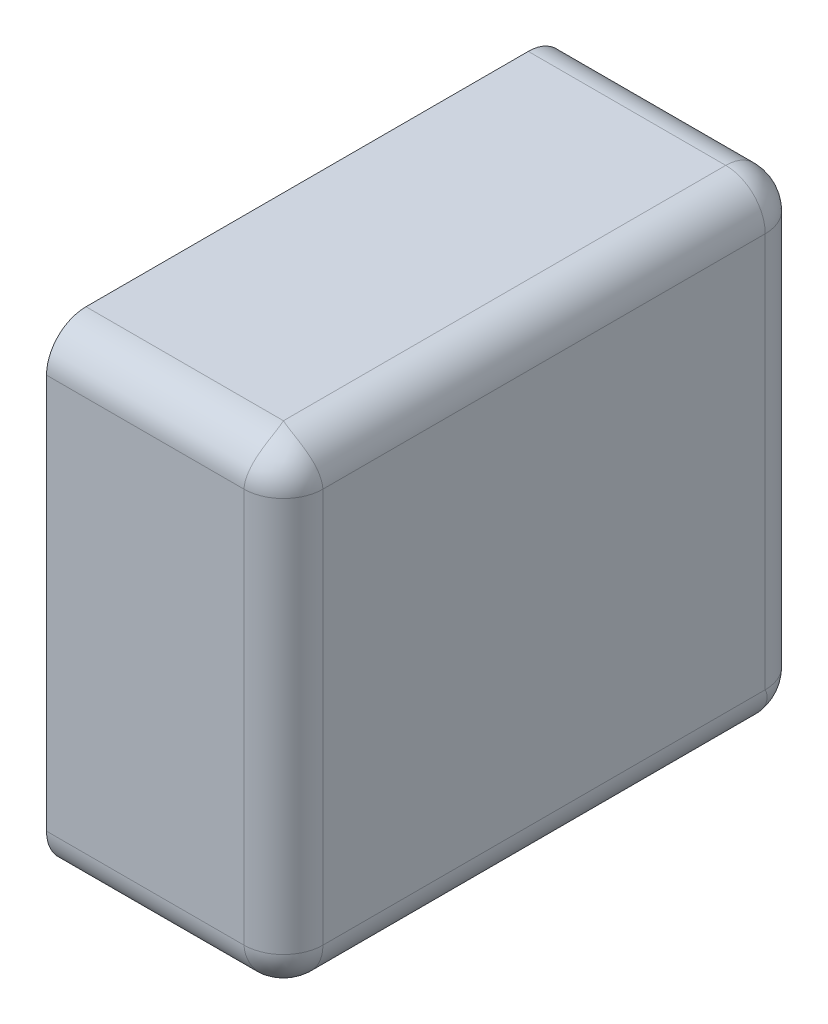
ISO-10303-21;
HEADER;
FILE_DESCRIPTION(('STEP AP214'),'2;1');
FILE_NAME('part.step','',(''),(''),'','','');
FILE_SCHEMA(('AUTOMOTIVE_DESIGN { 1 0 10303 214 1 1 1 1 }'));
ENDSEC;
DATA;
#1=APPLICATION_CONTEXT('core data for automotive mechanical design processes');
#2=APPLICATION_PROTOCOL_DEFINITION('international standard','automotive_design',2000,#1);
#3=PRODUCT_CONTEXT('',#1,'mechanical');
#4=PRODUCT('Part','Part','',(#3));
#5=PRODUCT_RELATED_PRODUCT_CATEGORY('part','',(#4));
#6=PRODUCT_DEFINITION_FORMATION('','',#4);
#7=PRODUCT_DEFINITION_CONTEXT('part definition',#1,'design');
#8=PRODUCT_DEFINITION('design','',#6,#7);
#9=PRODUCT_DEFINITION_SHAPE('','',#8);
#10=(LENGTH_UNIT() NAMED_UNIT(*) SI_UNIT(.MILLI.,.METRE.));
#11=(NAMED_UNIT(*) PLANE_ANGLE_UNIT() SI_UNIT($,.RADIAN.));
#12=(NAMED_UNIT(*) SI_UNIT($,.STERADIAN.) SOLID_ANGLE_UNIT());
#13=UNCERTAINTY_MEASURE_WITH_UNIT(LENGTH_MEASURE(1.E-05),#10,'distance_accuracy_value','');
#14=(GEOMETRIC_REPRESENTATION_CONTEXT(3) GLOBAL_UNCERTAINTY_ASSIGNED_CONTEXT((#13)) GLOBAL_UNIT_ASSIGNED_CONTEXT((#10,
#11,#12)) REPRESENTATION_CONTEXT('',''));
#15=CARTESIAN_POINT('',(0.,0.,0.));
#16=DIRECTION('',(0.,0.,1.));
#17=DIRECTION('',(1.,0.,0.));
#18=AXIS2_PLACEMENT_3D('',#15,#16,#17);
#19=CARTESIAN_POINT('',(0.275,-0.125,0.305));
#20=DIRECTION('',(-0.408248290463863,-0.816496580927726,-0.408248290463863));
#21=DIRECTION('',(0.577350269189626,-0.577350269189626,0.577350269189626));
#22=AXIS2_PLACEMENT_3D('',#19,#20,#21);
#23=SPHERICAL_SURFACE('',#22,0.025);
#24=CARTESIAN_POINT('',(0.275,-0.125,0.33));
#25=CARTESIAN_POINT('',(0.275028238320441,-0.125415676213834,0.330000010156983));
#26=CARTESIAN_POINT('',(0.275060584155778,-0.125831055562414,0.329989585658774));
#27=CARTESIAN_POINT('',(0.275132695597811,-0.126662012124376,0.329947847782519));
#28=CARTESIAN_POINT('',(0.27517249400072,-0.127077581785769,0.329916440434029));
#29=CARTESIAN_POINT('',(0.275258617335822,-0.127907618053038,0.329832548789631));
#30=CARTESIAN_POINT('',(0.275304968016668,-0.128322073397476,0.329779979751279));
#31=CARTESIAN_POINT('',(0.275403260408353,-0.129148608322681,0.329653686199178));
#32=CARTESIAN_POINT('',(0.275455221450125,-0.12956067417861,0.329579886981704));
#33=CARTESIAN_POINT('',(0.275563764376431,-0.130381173624576,0.329411146196174));
#34=CARTESIAN_POINT('',(0.275620359933804,-0.130789592213412,0.329316140529283));
#35=CARTESIAN_POINT('',(0.275737172088313,-0.131601566008371,0.329105097640512));
#36=CARTESIAN_POINT('',(0.275797397561427,-0.132005106135568,0.328989007342185));
#37=CARTESIAN_POINT('',(0.275920446097788,-0.132806120583724,0.328736002631376));
#38=CARTESIAN_POINT('',(0.275983274187963,-0.13320358092159,0.328599046407018));
#39=CARTESIAN_POINT('',(0.276110486774537,-0.133991266766944,0.328304614200733));
#40=CARTESIAN_POINT('',(0.276174873464478,-0.134381480526085,0.32814710774299));
#41=CARTESIAN_POINT('',(0.276304150405427,-0.135153541708901,0.32781197565844));
#42=CARTESIAN_POINT('',(0.276369041081861,-0.135535380708937,0.327634330792106));
#43=CARTESIAN_POINT('',(0.2764982676242,-0.136289602430892,0.327259417678732));
#44=CARTESIAN_POINT('',(0.276562603243719,-0.136661981083052,0.327062141159939));
#45=CARTESIAN_POINT('',(0.276689661956486,-0.137396237536021,0.326648554189678));
#46=CARTESIAN_POINT('',(0.276752385240264,-0.137758116578225,0.326432246000668));
#47=CARTESIAN_POINT('',(0.276875168414075,-0.138470378199732,0.325981276798632));
#48=CARTESIAN_POINT('',(0.276935230034102,-0.138820768206836,0.325746627988922));
#49=CARTESIAN_POINT('',(0.277051652032446,-0.139509108460251,0.32525974785284));
#50=CARTESIAN_POINT('',(0.277108016758089,-0.139847073104693,0.32500753792424));
#51=CARTESIAN_POINT('',(0.277216026256487,-0.140509674749009,0.324486392144794));
#52=CARTESIAN_POINT('',(0.277267679028739,-0.140834333801393,0.324217485995022));
#53=CARTESIAN_POINT('',(0.27736527107724,-0.141469494627518,0.323663887304665));
#54=CARTESIAN_POINT('',(0.277411222978854,-0.141780026684489,0.323379231742463));
#55=CARTESIAN_POINT('',(0.277496450824535,-0.142386164695101,0.322795152921738));
#56=CARTESIAN_POINT('',(0.277535744914638,-0.14268180962415,0.32249577276969));
#57=CARTESIAN_POINT('',(0.27760673152198,-0.143257467637576,0.321883338445124));
#58=CARTESIAN_POINT('',(0.277638448504513,-0.143537528729595,0.32157033224817));
#59=CARTESIAN_POINT('',(0.277693397712977,-0.144081378390888,0.32093180991951));
#60=CARTESIAN_POINT('',(0.277716661409129,-0.144345224212838,0.320606345279046));
#61=CARTESIAN_POINT('',(0.277753868669339,-0.144856069398077,0.319944135618163));
#62=CARTESIAN_POINT('',(0.277767851265375,-0.145103135339482,0.319607444174292));
#63=CARTESIAN_POINT('',(0.277785713896754,-0.145579914942669,0.318924070639427));
#64=CARTESIAN_POINT('',(0.277789640938912,-0.145809704451679,0.318577442722618));
#65=CARTESIAN_POINT('',(0.27778666785663,-0.146251494545238,0.317875540543628));
#66=CARTESIAN_POINT('',(0.277779822969552,-0.146463580049632,0.317520319530239));
#67=CARTESIAN_POINT('',(0.277754643821881,-0.146869595417803,0.316802624092122));
#68=CARTESIAN_POINT('',(0.277736373115599,-0.147063618935002,0.316440200456916));
#69=CARTESIAN_POINT('',(0.277687746810916,-0.147433213963009,0.315709535228763));
#70=CARTESIAN_POINT('',(0.277657462990763,-0.147608887378239,0.315341340447619));
#71=CARTESIAN_POINT('',(0.277584285466496,-0.147941556355398,0.314600604173974));
#72=CARTESIAN_POINT('',(0.277541471485359,-0.148098661446718,0.314228104043934));
#73=CARTESIAN_POINT('',(0.277442783056288,-0.148394038077465,0.313480258519227));
#74=CARTESIAN_POINT('',(0.277386995803688,-0.148532426005439,0.313104947635931));
#75=CARTESIAN_POINT('',(0.277261986649696,-0.148790282913471,0.312353001463475));
#76=CARTESIAN_POINT('',(0.277192858759549,-0.148909874234575,0.311976392569098));
#77=CARTESIAN_POINT('',(0.277040877699208,-0.149130119595873,0.311223398192717));
#78=CARTESIAN_POINT('',(0.276958124481167,-0.149230900910104,0.310847029768722));
#79=CARTESIAN_POINT('',(0.27677867186318,-0.149413582847158,0.310096030213761));
#80=CARTESIAN_POINT('',(0.276682077415673,-0.149495614474251,0.309721406146137));
#81=CARTESIAN_POINT('',(0.276526366184805,-0.149604779367685,0.30916097275375));
#82=CARTESIAN_POINT('',(0.276472819440888,-0.149638780077472,0.308974916302159));
#83=CARTESIAN_POINT('',(0.276362215583349,-0.14970212944545,0.308603818714183));
#84=CARTESIAN_POINT('',(0.276305172220562,-0.14973149488389,0.308418776370976));
#85=CARTESIAN_POINT('',(0.276187574740664,-0.149785596680384,0.30804990634783));
#86=CARTESIAN_POINT('',(0.276127034494639,-0.149810349876557,0.307866076710932));
#87=CARTESIAN_POINT('',(0.276002446002005,-0.149855256493048,0.30749982091122));
#88=CARTESIAN_POINT('',(0.275938411709227,-0.149875426755908,0.307317392070842));
#89=CARTESIAN_POINT('',(0.275806843842845,-0.149911199948112,0.306954128152848));
#90=CARTESIAN_POINT('',(0.275739324256391,-0.149926819681761,0.306773289666063));
#91=CARTESIAN_POINT('',(0.275600799894891,-0.149953528249625,0.306413394821305));
#92=CARTESIAN_POINT('',(0.275529809091912,-0.149964633803205,0.306234334328419));
#93=CARTESIAN_POINT('',(0.275384361385913,-0.149982353760455,0.305878182225797));
#94=CARTESIAN_POINT('',(0.275309918391982,-0.149988984753714,0.305701085764511));
#95=CARTESIAN_POINT('',(0.275157592486941,-0.149997800037759,0.305349047666083));
#96=CARTESIAN_POINT('',(0.27507972336566,-0.150000000737951,0.305174100471466));
#97=CARTESIAN_POINT('',(0.275,-0.15,0.305));
#98=B_SPLINE_CURVE_WITH_KNOTS('',3,(#24,#25,#26,#27,#28,#29,#30,#31,#32,#33,#34,#35,#36,#37,#38,
#39,#40,#41,#42,#43,#44,#45,#46,#47,#48,#49,#50,#51,#52,#53,#54,#55,#56,#57,#58,#59,#60,#61,#62,
#63,#64,#65,#66,#67,#68,#69,#70,#71,#72,#73,#74,#75,#76,#77,#78,#79,#80,#81,#82,#83,#84,#85,#86,
#87,#88,#89,#90,#91,#92,#93,#94,#95,#96,#97),.UNSPECIFIED.,.F.,.F.,(4,2,2,2,2,2,2,2,2,2,2,2,2,2,
2,2,2,2,2,2,2,2,2,2,2,2,2,2,2,2,2,2,2,2,2,2,4),(0.,0.00124972674914429,0.00250508818118087,
0.00376552755498708,0.00503045751811208,0.00629926393006443,0.00757130973543103,
0.008845938876384,0.0101224802356455,0.0114002516022038,0.0126785636530195,0.0139567239446434,
0.0152340409091005,0.0165098278485827,0.0177834069234384,0.0190541131276553,0.0203212982454898,
0.0215843347821014,0.0228426198599832,0.0240955790716335,0.0253426702772639,0.0265833873343771,
0.0278172637437544,0.0290438761937642,0.0302628479819393,0.0314738522894821,0.0326766152807867,
0.0338709189962572,0.0350566040027588,0.0356462463463343,0.0362337025741548,0.0368189702268576,
0.0374020508853402,0.0379829502134117,0.0385616779934515,0.0391382481546671,0.0397126787935412),.UNSPECIFIED.);
#99=CARTESIAN_POINT('',(0.275,-0.125,0.33));
#100=VERTEX_POINT('',#99);
#101=CARTESIAN_POINT('',(0.275,-0.15,0.305));
#102=VERTEX_POINT('',#101);
#103=EDGE_CURVE('E11',#100,#102,#98,.T.);
#104=ORIENTED_EDGE('',*,*,#103,.T.);
#105=CARTESIAN_POINT('',(0.275,-0.125,0.305));
#106=DIRECTION('',(0.,0.,1.));
#107=DIRECTION('',(1.,0.,0.));
#108=AXIS2_PLACEMENT_3D('',#105,#106,#107);
#109=CIRCLE('',#108,0.025);
#110=CARTESIAN_POINT('',(0.3,-0.125,0.305));
#111=VERTEX_POINT('',#110);
#112=EDGE_CURVE('E25',#102,#111,#109,.T.);
#113=ORIENTED_EDGE('',*,*,#112,.T.);
#114=CARTESIAN_POINT('',(0.275,-0.125,0.305));
#115=DIRECTION('',(0.,-1.,0.));
#116=DIRECTION('',(0.,0.,1.));
#117=AXIS2_PLACEMENT_3D('',#114,#115,#116);
#118=CIRCLE('',#117,0.025);
#119=EDGE_CURVE('E279',#111,#100,#118,.T.);
#120=ORIENTED_EDGE('',*,*,#119,.T.);
#121=EDGE_LOOP('',(#104,#113,#120));
#122=FACE_BOUND('',#121,.T.);
#123=ADVANCED_FACE('F17',(#122),#23,.T.);
#124=CARTESIAN_POINT('',(0.275,-0.125,0.025));
#125=DIRECTION('',(-0.816496580927726,-0.408248290463864,-0.408248290463863));
#126=DIRECTION('',(0.577350269189626,-0.577350269189626,-0.577350269189626));
#127=AXIS2_PLACEMENT_3D('',#124,#125,#126);
#128=SPHERICAL_SURFACE('',#127,0.025);
#129=CARTESIAN_POINT('',(0.3,-0.125,0.025));
#130=CARTESIAN_POINT('',(0.300000000737951,-0.125174100471466,0.0249202766343398));
#131=CARTESIAN_POINT('',(0.299997800037759,-0.125349047666083,0.0248424075130585));
#132=CARTESIAN_POINT('',(0.299988984753714,-0.125701085764511,0.0246900816080177));
#133=CARTESIAN_POINT('',(0.299982353760455,-0.125878182225797,0.0246156386140871));
#134=CARTESIAN_POINT('',(0.299964633803205,-0.126234334328419,0.0244701909080881));
#135=CARTESIAN_POINT('',(0.299953528249625,-0.126413394821305,0.0243992001051096));
#136=CARTESIAN_POINT('',(0.299926819681761,-0.126773289666063,0.0242606757436093));
#137=CARTESIAN_POINT('',(0.299911199948112,-0.126954128152848,0.0241931561571548));
#138=CARTESIAN_POINT('',(0.299875426755908,-0.127317392070842,0.0240615882907726));
#139=CARTESIAN_POINT('',(0.299855256493048,-0.12749982091122,0.0239975539979947));
#140=CARTESIAN_POINT('',(0.299810349876557,-0.127866076710932,0.023872965505361));
#141=CARTESIAN_POINT('',(0.299785596680384,-0.12804990634783,0.0238124252593363));
#142=CARTESIAN_POINT('',(0.29973149488389,-0.128418776370976,0.0236948277794382));
#143=CARTESIAN_POINT('',(0.29970212944545,-0.128603818714183,0.0236377844166513));
#144=CARTESIAN_POINT('',(0.299638780077472,-0.128974916302159,0.0235271805591116));
#145=CARTESIAN_POINT('',(0.299604779367685,-0.12916097275375,0.0234736338151953));
#146=CARTESIAN_POINT('',(0.299495614474251,-0.129721406146137,0.023317922584327));
#147=CARTESIAN_POINT('',(0.299413582847159,-0.130096030213761,0.0232213281368203));
#148=CARTESIAN_POINT('',(0.299230900910104,-0.130847029768722,0.0230418755188332));
#149=CARTESIAN_POINT('',(0.299130119595873,-0.131223398192717,0.0229591223007916));
#150=CARTESIAN_POINT('',(0.298909874234575,-0.131976392569098,0.0228071412404509));
#151=CARTESIAN_POINT('',(0.298790282913471,-0.132353001463475,0.0227380133503036));
#152=CARTESIAN_POINT('',(0.298532426005439,-0.133104947635931,0.0226130041963119));
#153=CARTESIAN_POINT('',(0.298394038077466,-0.133480258519227,0.0225572169437125));
#154=CARTESIAN_POINT('',(0.298098661446718,-0.134228104043934,0.0224585285146415));
#155=CARTESIAN_POINT('',(0.297941556355398,-0.134600604173974,0.0224157145335039));
#156=CARTESIAN_POINT('',(0.297608887378239,-0.135341340447619,0.0223425370092372));
#157=CARTESIAN_POINT('',(0.297433213963008,-0.135709535228763,0.0223122531890843));
#158=CARTESIAN_POINT('',(0.297063618935002,-0.136440200456916,0.0222636268844006));
#159=CARTESIAN_POINT('',(0.296869595417803,-0.136802624092122,0.0222453561781187));
#160=CARTESIAN_POINT('',(0.296463580049632,-0.137520319530238,0.0222201770304482));
#161=CARTESIAN_POINT('',(0.296251494545238,-0.137875540543628,0.0222133321433696));
#162=CARTESIAN_POINT('',(0.295809704451679,-0.138577442722618,0.0222103590610882));
#163=CARTESIAN_POINT('',(0.295579914942669,-0.138924070639427,0.0222142861032459));
#164=CARTESIAN_POINT('',(0.295103135339482,-0.139607444174292,0.022232148734625));
#165=CARTESIAN_POINT('',(0.294856069398077,-0.139944135618163,0.0222461313306608));
#166=CARTESIAN_POINT('',(0.294345224212838,-0.140606345279047,0.0222833385908708));
#167=CARTESIAN_POINT('',(0.294081378390888,-0.14093180991951,0.0223066022870233));
#168=CARTESIAN_POINT('',(0.293537528729595,-0.14157033224817,0.0223615514954871));
#169=CARTESIAN_POINT('',(0.293257467637576,-0.141883338445124,0.0223932684780205));
#170=CARTESIAN_POINT('',(0.29268180962415,-0.14249577276969,0.0224642550853625));
#171=CARTESIAN_POINT('',(0.292386164695101,-0.142795152921738,0.0225035491754646));
#172=CARTESIAN_POINT('',(0.291780026684489,-0.143379231742463,0.0225887770211462));
#173=CARTESIAN_POINT('',(0.291469494627518,-0.143663887304665,0.0226347289227604));
#174=CARTESIAN_POINT('',(0.290834333801393,-0.144217485995022,0.0227323209712611));
#175=CARTESIAN_POINT('',(0.290509674749009,-0.144486392144794,0.0227839737435128));
#176=CARTESIAN_POINT('',(0.289847073104693,-0.14500753792424,0.0228919832419115));
#177=CARTESIAN_POINT('',(0.289509108460251,-0.14525974785284,0.0229483479675545));
#178=CARTESIAN_POINT('',(0.288820768206836,-0.145746627988922,0.0230647699658976));
#179=CARTESIAN_POINT('',(0.288470378199732,-0.145981276798632,0.0231248315859255));
#180=CARTESIAN_POINT('',(0.287758116578225,-0.146432246000668,0.023247614759736));
#181=CARTESIAN_POINT('',(0.287396237536021,-0.146648554189678,0.0233103380435141));
#182=CARTESIAN_POINT('',(0.286661981083052,-0.147062141159939,0.0234373967562814));
#183=CARTESIAN_POINT('',(0.286289602430892,-0.147259417678732,0.0235017323758004));
#184=CARTESIAN_POINT('',(0.285535380708937,-0.147634330792106,0.0236309589181388));
#185=CARTESIAN_POINT('',(0.285153541708901,-0.14781197565844,0.0236958495945734));
#186=CARTESIAN_POINT('',(0.284381480526085,-0.14814710774299,0.0238251265355221));
#187=CARTESIAN_POINT('',(0.283991266766944,-0.148304614200733,0.0238895132254628));
#188=CARTESIAN_POINT('',(0.28320358092159,-0.148599046407018,0.0240167258120374));
#189=CARTESIAN_POINT('',(0.282806120583724,-0.148736002631376,0.0240795539022123));
#190=CARTESIAN_POINT('',(0.282005106135568,-0.148989007342185,0.0242026024385734));
#191=CARTESIAN_POINT('',(0.281601566008371,-0.149105097640512,0.0242628279116871));
#192=CARTESIAN_POINT('',(0.280789592213412,-0.149316140529283,0.0243796400661957));
#193=CARTESIAN_POINT('',(0.280381173624576,-0.149411146196174,0.0244362356235691));
#194=CARTESIAN_POINT('',(0.27956067417861,-0.149579886981704,0.0245447785498749));
#195=CARTESIAN_POINT('',(0.279148608322681,-0.149653686199178,0.0245967395916468));
#196=CARTESIAN_POINT('',(0.278322073397476,-0.149779979751279,0.0246950319833321));
#197=CARTESIAN_POINT('',(0.277907618053038,-0.149832548789631,0.0247413826641783));
#198=CARTESIAN_POINT('',(0.277077581785769,-0.149916440434029,0.0248275059992805));
#199=CARTESIAN_POINT('',(0.276662012124376,-0.149947847782519,0.0248673044021885));
#200=CARTESIAN_POINT('',(0.275831055562414,-0.149989585658774,0.0249394158442217));
#201=CARTESIAN_POINT('',(0.275415676213834,-0.150000010156983,0.0249717616795592));
#202=CARTESIAN_POINT('',(0.275,-0.15,0.025));
#203=B_SPLINE_CURVE_WITH_KNOTS('',3,(#129,#130,#131,#132,#133,#134,#135,#136,#137,#138,#139,
#140,#141,#142,#143,#144,#145,#146,#147,#148,#149,#150,#151,#152,#153,#154,#155,#156,#157,#158,
#159,#160,#161,#162,#163,#164,#165,#166,#167,#168,#169,#170,#171,#172,#173,#174,#175,#176,#177,
#178,#179,#180,#181,#182,#183,#184,#185,#186,#187,#188,#189,#190,#191,#192,#193,#194,#195,#196,
#197,#198,#199,#200,#201,#202),.UNSPECIFIED.,.F.,.F.,(4,2,2,2,2,2,2,2,2,2,2,2,2,2,2,2,2,2,2,2,2,
2,2,2,2,2,2,2,2,2,2,2,2,2,2,2,4),(0.,0.000574430638874108,0.00115100080008966,
0.00172972858012947,0.00231062790820101,0.00289370856668359,0.00347897621938641,
0.00406643244720695,0.00465607479078238,0.00584175979728407,0.00703606351275455,
0.00823882650405907,0.00944983081160196,0.010668802599777,0.0118954150497868,0.013129291459164,
0.0143700085162773,0.0156170997219077,0.016870058933558,0.0181283440114399,0.0193913805480515,
0.020658565665886,0.0219292718701028,0.0232028509449585,0.0244786378844408,0.0257559548488978,
0.0270341151405217,0.0283124271913374,0.0295901985578957,0.0308667399171573,0.0321413690581102,
0.0334134148634768,0.0346822212754292,0.0359471512385541,0.0372075906123603,0.038462952044397,
0.0397126787935412),.UNSPECIFIED.);
#204=CARTESIAN_POINT('',(0.3,-0.125,0.025));
#205=VERTEX_POINT('',#204);
#206=CARTESIAN_POINT('',(0.275,-0.15,0.025));
#207=VERTEX_POINT('',#206);
#208=EDGE_CURVE('E275',#205,#207,#203,.T.);
#209=ORIENTED_EDGE('',*,*,#208,.T.);
#210=CARTESIAN_POINT('',(0.275,-0.125,0.025));
#211=DIRECTION('',(1.,0.,0.));
#212=DIRECTION('',(0.,0.,-1.));
#213=AXIS2_PLACEMENT_3D('',#210,#211,#212);
#214=CIRCLE('',#213,0.025);
#215=CARTESIAN_POINT('',(0.275,-0.125,0.));
#216=VERTEX_POINT('',#215);
#217=EDGE_CURVE('E304',#207,#216,#214,.T.);
#218=ORIENTED_EDGE('',*,*,#217,.T.);
#219=CARTESIAN_POINT('',(0.275,-0.125,0.025));
#220=DIRECTION('',(0.,-1.,0.));
#221=DIRECTION('',(1.,0.,0.));
#222=AXIS2_PLACEMENT_3D('',#219,#220,#221);
#223=CIRCLE('',#222,0.025);
#224=EDGE_CURVE('E311',#216,#205,#223,.T.);
#225=ORIENTED_EDGE('',*,*,#224,.T.);
#226=EDGE_LOOP('',(#209,#218,#225));
#227=FACE_BOUND('',#226,.T.);
#228=ADVANCED_FACE('F257',(#227),#128,.T.);
#229=CARTESIAN_POINT('',(0.1875,-0.125,0.025));
#230=DIRECTION('',(1.,0.,0.));
#231=DIRECTION('',(0.,-0.707106781186548,-0.707106781186547));
#232=AXIS2_PLACEMENT_3D('',#229,#230,#231);
#233=CYLINDRICAL_SURFACE('',#232,0.025);
#234=CARTESIAN_POINT('',(0.15,-0.125,0.025));
#235=DIRECTION('',(1.,0.,0.));
#236=DIRECTION('',(0.,-0.707106781186548,-0.707106781186547));
#237=AXIS2_PLACEMENT_3D('',#234,#235,#236);
#238=CIRCLE('',#237,0.025);
#239=CARTESIAN_POINT('',(0.15,-0.15,0.025));
#240=VERTEX_POINT('',#239);
#241=CARTESIAN_POINT('',(0.15,-0.125,0.));
#242=VERTEX_POINT('',#241);
#243=EDGE_CURVE('E315',#240,#242,#238,.T.);
#244=ORIENTED_EDGE('',*,*,#243,.T.);
#245=DIRECTION('',(1.,0.,0.));
#246=VECTOR('',#245,1.);
#247=CARTESIAN_POINT('',(0.1875,-0.125,0.));
#248=LINE('',#247,#246);
#249=EDGE_CURVE('E319',#242,#216,#248,.T.);
#250=ORIENTED_EDGE('',*,*,#249,.T.);
#251=ORIENTED_EDGE('',*,*,#217,.F.);
#252=DIRECTION('',(-1.,0.,0.));
#253=VECTOR('',#252,1.);
#254=CARTESIAN_POINT('',(0.1875,-0.15,0.025));
#255=LINE('',#254,#253);
#256=EDGE_CURVE('E322',#207,#240,#255,.T.);
#257=ORIENTED_EDGE('',*,*,#256,.T.);
#258=EDGE_LOOP('',(#244,#250,#251,#257));
#259=FACE_BOUND('',#258,.T.);
#260=ADVANCED_FACE('F246',(#259),#233,.T.);
#261=CARTESIAN_POINT('',(0.275,0.125,0.305));
#262=DIRECTION('',(0.408248290463862,-0.816496580927727,0.408248290463862));
#263=DIRECTION('',(0.577350269189627,0.577350269189624,0.577350269189627));
#264=AXIS2_PLACEMENT_3D('',#261,#262,#263);
#265=SPHERICAL_SURFACE('',#264,0.025);
#266=CARTESIAN_POINT('',(0.275,0.125,0.305));
#267=DIRECTION('',(0.,1.,0.));
#268=DIRECTION('',(1.,0.,0.));
#269=AXIS2_PLACEMENT_3D('',#266,#267,#268);
#270=CIRCLE('',#269,0.025);
#271=CARTESIAN_POINT('',(0.275,0.125,0.33));
#272=VERTEX_POINT('',#271);
#273=CARTESIAN_POINT('',(0.3,0.125,0.305));
#274=VERTEX_POINT('',#273);
#275=EDGE_CURVE('E325',#272,#274,#270,.T.);
#276=ORIENTED_EDGE('',*,*,#275,.T.);
#277=CARTESIAN_POINT('',(0.3,0.125,0.305));
#278=CARTESIAN_POINT('',(0.300000010156984,0.125415676213834,0.305028238320441));
#279=CARTESIAN_POINT('',(0.299989585658774,0.125831055562414,0.305060584155778));
#280=CARTESIAN_POINT('',(0.299947847782519,0.126662012124376,0.305132695597811));
#281=CARTESIAN_POINT('',(0.299916440434029,0.127077581785769,0.30517249400072));
#282=CARTESIAN_POINT('',(0.299832548789631,0.127907618053038,0.305258617335822));
#283=CARTESIAN_POINT('',(0.299779979751279,0.128322073397476,0.305304968016668));
#284=CARTESIAN_POINT('',(0.299653686199178,0.129148608322681,0.305403260408353));
#285=CARTESIAN_POINT('',(0.299579886981704,0.12956067417861,0.305455221450125));
#286=CARTESIAN_POINT('',(0.299411146196174,0.130381173624576,0.305563764376431));
#287=CARTESIAN_POINT('',(0.299316140529283,0.130789592213412,0.305620359933804));
#288=CARTESIAN_POINT('',(0.299105097640512,0.131601566008371,0.305737172088313));
#289=CARTESIAN_POINT('',(0.298989007342185,0.132005106135568,0.305797397561427));
#290=CARTESIAN_POINT('',(0.298736002631376,0.132806120583724,0.305920446097788));
#291=CARTESIAN_POINT('',(0.298599046407018,0.13320358092159,0.305983274187963));
#292=CARTESIAN_POINT('',(0.298304614200733,0.133991266766944,0.306110486774537));
#293=CARTESIAN_POINT('',(0.29814710774299,0.134381480526085,0.306174873464478));
#294=CARTESIAN_POINT('',(0.29781197565844,0.135153541708901,0.306304150405427));
#295=CARTESIAN_POINT('',(0.297634330792106,0.135535380708937,0.306369041081861));
#296=CARTESIAN_POINT('',(0.297259417678732,0.136289602430892,0.3064982676242));
#297=CARTESIAN_POINT('',(0.297062141159939,0.136661981083052,0.306562603243719));
#298=CARTESIAN_POINT('',(0.296648554189678,0.137396237536021,0.306689661956486));
#299=CARTESIAN_POINT('',(0.296432246000668,0.137758116578225,0.306752385240264));
#300=CARTESIAN_POINT('',(0.295981276798632,0.138470378199732,0.306875168414075));
#301=CARTESIAN_POINT('',(0.295746627988922,0.138820768206836,0.306935230034102));
#302=CARTESIAN_POINT('',(0.29525974785284,0.139509108460252,0.307051652032446));
#303=CARTESIAN_POINT('',(0.29500753792424,0.139847073104693,0.307108016758089));
#304=CARTESIAN_POINT('',(0.294486392144794,0.140509674749009,0.307216026256487));
#305=CARTESIAN_POINT('',(0.294217485995022,0.140834333801393,0.307267679028739));
#306=CARTESIAN_POINT('',(0.293663887304665,0.141469494627518,0.30736527107724));
#307=CARTESIAN_POINT('',(0.293379231742463,0.141780026684489,0.307411222978854));
#308=CARTESIAN_POINT('',(0.292795152921738,0.142386164695101,0.307496450824535));
#309=CARTESIAN_POINT('',(0.29249577276969,0.14268180962415,0.307535744914638));
#310=CARTESIAN_POINT('',(0.291883338445124,0.143257467637576,0.30760673152198));
#311=CARTESIAN_POINT('',(0.29157033224817,0.143537528729595,0.307638448504513));
#312=CARTESIAN_POINT('',(0.29093180991951,0.144081378390888,0.307693397712977));
#313=CARTESIAN_POINT('',(0.290606345279046,0.144345224212838,0.307716661409129));
#314=CARTESIAN_POINT('',(0.289944135618163,0.144856069398077,0.307753868669339));
#315=CARTESIAN_POINT('',(0.289607444174292,0.145103135339482,0.307767851265375));
#316=CARTESIAN_POINT('',(0.288924070639427,0.145579914942669,0.307785713896754));
#317=CARTESIAN_POINT('',(0.288577442722618,0.145809704451679,0.307789640938912));
#318=CARTESIAN_POINT('',(0.287875540543628,0.146251494545238,0.30778666785663));
#319=CARTESIAN_POINT('',(0.287520319530238,0.146463580049632,0.307779822969552));
#320=CARTESIAN_POINT('',(0.286802624092122,0.146869595417803,0.307754643821881));
#321=CARTESIAN_POINT('',(0.286440200456916,0.147063618935002,0.307736373115599));
#322=CARTESIAN_POINT('',(0.285709535228763,0.147433213963009,0.307687746810916));
#323=CARTESIAN_POINT('',(0.285341340447619,0.147608887378239,0.307657462990763));
#324=CARTESIAN_POINT('',(0.284600604173974,0.147941556355398,0.307584285466496));
#325=CARTESIAN_POINT('',(0.284228104043934,0.148098661446718,0.307541471485358));
#326=CARTESIAN_POINT('',(0.283480258519227,0.148394038077466,0.307442783056287));
#327=CARTESIAN_POINT('',(0.283104947635931,0.148532426005439,0.307386995803688));
#328=CARTESIAN_POINT('',(0.282353001463475,0.148790282913471,0.307261986649696));
#329=CARTESIAN_POINT('',(0.281976392569098,0.148909874234575,0.307192858759549));
#330=CARTESIAN_POINT('',(0.281223398192717,0.149130119595873,0.307040877699208));
#331=CARTESIAN_POINT('',(0.280847029768722,0.149230900910104,0.306958124481167));
#332=CARTESIAN_POINT('',(0.280096030213761,0.149413582847158,0.30677867186318));
#333=CARTESIAN_POINT('',(0.279721406146137,0.149495614474251,0.306682077415673));
#334=CARTESIAN_POINT('',(0.27916097275375,0.149604779367685,0.306526366184805));
#335=CARTESIAN_POINT('',(0.278974916302159,0.149638780077472,0.306472819440888));
#336=CARTESIAN_POINT('',(0.278603818714183,0.14970212944545,0.306362215583349));
#337=CARTESIAN_POINT('',(0.278418776370976,0.14973149488389,0.306305172220562));
#338=CARTESIAN_POINT('',(0.27804990634783,0.149785596680384,0.306187574740664));
#339=CARTESIAN_POINT('',(0.277866076710932,0.149810349876557,0.306127034494639));
#340=CARTESIAN_POINT('',(0.27749982091122,0.149855256493048,0.306002446002005));
#341=CARTESIAN_POINT('',(0.277317392070842,0.149875426755908,0.305938411709227));
#342=CARTESIAN_POINT('',(0.276954128152848,0.149911199948112,0.305806843842845));
#343=CARTESIAN_POINT('',(0.276773289666063,0.149926819681761,0.305739324256391));
#344=CARTESIAN_POINT('',(0.276413394821305,0.149953528249625,0.30560079989489));
#345=CARTESIAN_POINT('',(0.276234334328419,0.149964633803205,0.305529809091912));
#346=CARTESIAN_POINT('',(0.275878182225797,0.149982353760455,0.305384361385913));
#347=CARTESIAN_POINT('',(0.275701085764511,0.149988984753714,0.305309918391982));
#348=CARTESIAN_POINT('',(0.275349047666083,0.149997800037759,0.305157592486941));
#349=CARTESIAN_POINT('',(0.275174100471466,0.150000000737951,0.30507972336566));
#350=CARTESIAN_POINT('',(0.275,0.15,0.305));
#351=B_SPLINE_CURVE_WITH_KNOTS('',3,(#277,#278,#279,#280,#281,#282,#283,#284,#285,#286,#287,
#288,#289,#290,#291,#292,#293,#294,#295,#296,#297,#298,#299,#300,#301,#302,#303,#304,#305,#306,
#307,#308,#309,#310,#311,#312,#313,#314,#315,#316,#317,#318,#319,#320,#321,#322,#323,#324,#325,
#326,#327,#328,#329,#330,#331,#332,#333,#334,#335,#336,#337,#338,#339,#340,#341,#342,#343,#344,
#345,#346,#347,#348,#349,#350),.UNSPECIFIED.,.F.,.F.,(4,2,2,2,2,2,2,2,2,2,2,2,2,2,2,2,2,2,2,2,2,
2,2,2,2,2,2,2,2,2,2,2,2,2,2,2,4),(0.,0.00124972674914427,0.00250508818118087,
0.00376552755498708,0.00503045751811208,0.00629926393006441,0.00757130973543101,
0.00884593887638399,0.0101224802356455,0.0114002516022038,0.0126785636530195,0.0139567239446433,
0.0152340409091005,0.0165098278485827,0.0177834069234384,0.0190541131276553,0.0203212982454898,
0.0215843347821014,0.0228426198599832,0.0240955790716335,0.0253426702772639,0.0265833873343772,
0.0278172637437543,0.0290438761937642,0.0302628479819393,0.0314738522894822,0.0326766152807867,
0.0338709189962572,0.0350566040027589,0.0356462463463343,0.0362337025741548,0.0368189702268576,
0.0374020508853402,0.0379829502134117,0.0385616779934515,0.0391382481546671,0.0397126787935412),.UNSPECIFIED.);
#352=CARTESIAN_POINT('',(0.275,0.15,0.305));
#353=VERTEX_POINT('',#352);
#354=EDGE_CURVE('E228',#274,#353,#351,.T.);
#355=ORIENTED_EDGE('',*,*,#354,.T.);
#356=CARTESIAN_POINT('',(0.275,0.15,0.305));
#357=CARTESIAN_POINT('',(0.27507972336566,0.150000000737951,0.305174100471466));
#358=CARTESIAN_POINT('',(0.275157592486941,0.149997800037759,0.305349047666083));
#359=CARTESIAN_POINT('',(0.275309918391982,0.149988984753714,0.30570108576451));
#360=CARTESIAN_POINT('',(0.275384361385913,0.149982353760455,0.305878182225797));
#361=CARTESIAN_POINT('',(0.275529809091912,0.149964633803205,0.306234334328419));
#362=CARTESIAN_POINT('',(0.27560079989489,0.149953528249625,0.306413394821305));
#363=CARTESIAN_POINT('',(0.275739324256391,0.149926819681761,0.306773289666063));
#364=CARTESIAN_POINT('',(0.275806843842845,0.149911199948112,0.306954128152848));
#365=CARTESIAN_POINT('',(0.275938411709227,0.149875426755908,0.307317392070842));
#366=CARTESIAN_POINT('',(0.276002446002005,0.149855256493048,0.30749982091122));
#367=CARTESIAN_POINT('',(0.276127034494639,0.149810349876557,0.307866076710932));
#368=CARTESIAN_POINT('',(0.276187574740664,0.149785596680384,0.30804990634783));
#369=CARTESIAN_POINT('',(0.276305172220562,0.14973149488389,0.308418776370976));
#370=CARTESIAN_POINT('',(0.276362215583349,0.14970212944545,0.308603818714183));
#371=CARTESIAN_POINT('',(0.276472819440888,0.149638780077472,0.308974916302159));
#372=CARTESIAN_POINT('',(0.276526366184805,0.149604779367685,0.30916097275375));
#373=CARTESIAN_POINT('',(0.276682077415673,0.149495614474251,0.309721406146137));
#374=CARTESIAN_POINT('',(0.27677867186318,0.149413582847159,0.310096030213761));
#375=CARTESIAN_POINT('',(0.276958124481167,0.149230900910104,0.310847029768722));
#376=CARTESIAN_POINT('',(0.277040877699208,0.149130119595873,0.311223398192717));
#377=CARTESIAN_POINT('',(0.277192858759549,0.148909874234575,0.311976392569098));
#378=CARTESIAN_POINT('',(0.277261986649696,0.148790282913471,0.312353001463475));
#379=CARTESIAN_POINT('',(0.277386995803688,0.148532426005439,0.313104947635931));
#380=CARTESIAN_POINT('',(0.277442783056288,0.148394038077466,0.313480258519227));
#381=CARTESIAN_POINT('',(0.277541471485359,0.148098661446718,0.314228104043934));
#382=CARTESIAN_POINT('',(0.277584285466496,0.147941556355398,0.314600604173974));
#383=CARTESIAN_POINT('',(0.277657462990763,0.147608887378239,0.315341340447619));
#384=CARTESIAN_POINT('',(0.277687746810916,0.147433213963009,0.315709535228763));
#385=CARTESIAN_POINT('',(0.277736373115599,0.147063618935002,0.316440200456916));
#386=CARTESIAN_POINT('',(0.277754643821881,0.146869595417803,0.316802624092122));
#387=CARTESIAN_POINT('',(0.277779822969552,0.146463580049632,0.317520319530238));
#388=CARTESIAN_POINT('',(0.27778666785663,0.146251494545238,0.317875540543628));
#389=CARTESIAN_POINT('',(0.277789640938912,0.145809704451679,0.318577442722617));
#390=CARTESIAN_POINT('',(0.277785713896754,0.145579914942669,0.318924070639427));
#391=CARTESIAN_POINT('',(0.277767851265375,0.145103135339482,0.319607444174292));
#392=CARTESIAN_POINT('',(0.277753868669339,0.144856069398077,0.319944135618163));
#393=CARTESIAN_POINT('',(0.277716661409129,0.144345224212838,0.320606345279046));
#394=CARTESIAN_POINT('',(0.277693397712977,0.144081378390888,0.32093180991951));
#395=CARTESIAN_POINT('',(0.277638448504513,0.143537528729595,0.32157033224817));
#396=CARTESIAN_POINT('',(0.27760673152198,0.143257467637576,0.321883338445124));
#397=CARTESIAN_POINT('',(0.277535744914638,0.14268180962415,0.32249577276969));
#398=CARTESIAN_POINT('',(0.277496450824535,0.142386164695101,0.322795152921738));
#399=CARTESIAN_POINT('',(0.277411222978854,0.141780026684489,0.323379231742463));
#400=CARTESIAN_POINT('',(0.27736527107724,0.141469494627518,0.323663887304665));
#401=CARTESIAN_POINT('',(0.277267679028739,0.140834333801393,0.324217485995022));
#402=CARTESIAN_POINT('',(0.277216026256487,0.140509674749009,0.324486392144794));
#403=CARTESIAN_POINT('',(0.277108016758089,0.139847073104693,0.32500753792424));
#404=CARTESIAN_POINT('',(0.277051652032446,0.139509108460252,0.32525974785284));
#405=CARTESIAN_POINT('',(0.276935230034102,0.138820768206836,0.325746627988922));
#406=CARTESIAN_POINT('',(0.276875168414075,0.138470378199732,0.325981276798632));
#407=CARTESIAN_POINT('',(0.276752385240264,0.137758116578225,0.326432246000668));
#408=CARTESIAN_POINT('',(0.276689661956486,0.137396237536021,0.326648554189678));
#409=CARTESIAN_POINT('',(0.276562603243719,0.136661981083052,0.327062141159939));
#410=CARTESIAN_POINT('',(0.2764982676242,0.136289602430892,0.327259417678732));
#411=CARTESIAN_POINT('',(0.276369041081861,0.135535380708937,0.327634330792106));
#412=CARTESIAN_POINT('',(0.276304150405427,0.135153541708901,0.32781197565844));
#413=CARTESIAN_POINT('',(0.276174873464478,0.134381480526085,0.32814710774299));
#414=CARTESIAN_POINT('',(0.276110486774537,0.133991266766944,0.328304614200733));
#415=CARTESIAN_POINT('',(0.275983274187963,0.13320358092159,0.328599046407018));
#416=CARTESIAN_POINT('',(0.275920446097788,0.132806120583724,0.328736002631376));
#417=CARTESIAN_POINT('',(0.275797397561427,0.132005106135568,0.328989007342185));
#418=CARTESIAN_POINT('',(0.275737172088313,0.131601566008371,0.329105097640512));
#419=CARTESIAN_POINT('',(0.275620359933804,0.130789592213412,0.329316140529283));
#420=CARTESIAN_POINT('',(0.275563764376431,0.130381173624576,0.329411146196174));
#421=CARTESIAN_POINT('',(0.275455221450125,0.12956067417861,0.329579886981704));
#422=CARTESIAN_POINT('',(0.275403260408353,0.129148608322681,0.329653686199178));
#423=CARTESIAN_POINT('',(0.275304968016668,0.128322073397476,0.329779979751279));
#424=CARTESIAN_POINT('',(0.275258617335822,0.127907618053038,0.329832548789631));
#425=CARTESIAN_POINT('',(0.27517249400072,0.127077581785769,0.329916440434029));
#426=CARTESIAN_POINT('',(0.275132695597812,0.126662012124376,0.329947847782519));
#427=CARTESIAN_POINT('',(0.275060584155778,0.125831055562414,0.329989585658774));
#428=CARTESIAN_POINT('',(0.275028238320441,0.125415676213834,0.330000010156983));
#429=CARTESIAN_POINT('',(0.275,0.125,0.33));
#430=B_SPLINE_CURVE_WITH_KNOTS('',3,(#356,#357,#358,#359,#360,#361,#362,#363,#364,#365,#366,
#367,#368,#369,#370,#371,#372,#373,#374,#375,#376,#377,#378,#379,#380,#381,#382,#383,#384,#385,
#386,#387,#388,#389,#390,#391,#392,#393,#394,#395,#396,#397,#398,#399,#400,#401,#402,#403,#404,
#405,#406,#407,#408,#409,#410,#411,#412,#413,#414,#415,#416,#417,#418,#419,#420,#421,#422,#423,
#424,#425,#426,#427,#428,#429),.UNSPECIFIED.,.F.,.F.,(4,2,2,2,2,2,2,2,2,2,2,2,2,2,2,2,2,2,2,2,2,
2,2,2,2,2,2,2,2,2,2,2,2,2,2,2,4),(0.,0.000574430638874099,0.00115100080008963,
0.00172972858012947,0.002310627908201,0.00289370856668354,0.00347897621938635,
0.00406643244720691,0.00465607479078235,0.00584175979728405,0.00703606351275453,
0.00823882650405904,0.0094498308116019,0.010668802599777,0.0118954150497868,0.013129291459164,
0.0143700085162772,0.0156170997219077,0.016870058933558,0.0181283440114398,0.0193913805480514,
0.0206585656658859,0.0219292718701028,0.0232028509449585,0.0244786378844407,0.0257559548488978,
0.0270341151405217,0.0283124271913373,0.0295901985578957,0.0308667399171572,0.0321413690581102,
0.0334134148634768,0.0346822212754291,0.0359471512385541,0.0372075906123603,0.0384629520443969,
0.0397126787935412),.UNSPECIFIED.);
#431=EDGE_CURVE('E188',#353,#272,#430,.T.);
#432=ORIENTED_EDGE('',*,*,#431,.T.);
#433=EDGE_LOOP('',(#276,#355,#432));
#434=FACE_BOUND('',#433,.T.);
#435=ADVANCED_FACE('F235',(#434),#265,.T.);
#436=CARTESIAN_POINT('',(0.275,0.125,0.025));
#437=DIRECTION('',(-0.816496580927726,0.408248290463863,-0.408248290463863));
#438=DIRECTION('',(0.577350269189626,0.577350269189626,-0.577350269189625));
#439=AXIS2_PLACEMENT_3D('',#436,#437,#438);
#440=SPHERICAL_SURFACE('',#439,0.025);
#441=CARTESIAN_POINT('',(0.275,0.125,0.025));
#442=DIRECTION('',(0.,0.,-1.));
#443=DIRECTION('',(1.,0.,0.));
#444=AXIS2_PLACEMENT_3D('',#441,#442,#443);
#445=CIRCLE('',#444,0.025);
#446=CARTESIAN_POINT('',(0.275,0.15,0.025));
#447=VERTEX_POINT('',#446);
#448=CARTESIAN_POINT('',(0.3,0.125,0.025));
#449=VERTEX_POINT('',#448);
#450=EDGE_CURVE('E186',#447,#449,#445,.T.);
#451=ORIENTED_EDGE('',*,*,#450,.T.);
#452=CARTESIAN_POINT('',(0.275,0.125,0.025));
#453=DIRECTION('',(0.,1.,0.));
#454=DIRECTION('',(0.,0.,-1.));
#455=AXIS2_PLACEMENT_3D('',#452,#453,#454);
#456=CIRCLE('',#455,0.025);
#457=CARTESIAN_POINT('',(0.275,0.125,0.));
#458=VERTEX_POINT('',#457);
#459=EDGE_CURVE('E184',#449,#458,#456,.T.);
#460=ORIENTED_EDGE('',*,*,#459,.T.);
#461=CARTESIAN_POINT('',(0.275,0.125,0.025));
#462=DIRECTION('',(1.,0.,0.));
#463=DIRECTION('',(0.,1.,0.));
#464=AXIS2_PLACEMENT_3D('',#461,#462,#463);
#465=CIRCLE('',#464,0.025);
#466=EDGE_CURVE('E181',#458,#447,#465,.T.);
#467=ORIENTED_EDGE('',*,*,#466,.T.);
#468=EDGE_LOOP('',(#451,#460,#467));
#469=FACE_BOUND('',#468,.T.);
#470=ADVANCED_FACE('F245',(#469),#440,.T.);
#471=CARTESIAN_POINT('',(0.275,-0.0750000000000001,0.025));
#472=DIRECTION('',(0.,1.,0.));
#473=DIRECTION('',(0.707106781186548,0.,-0.707106781186547));
#474=AXIS2_PLACEMENT_3D('',#471,#472,#473);
#475=CYLINDRICAL_SURFACE('',#474,0.025);
#476=ORIENTED_EDGE('',*,*,#459,.F.);
#477=DIRECTION('',(0.,-1.,0.));
#478=VECTOR('',#477,1.);
#479=CARTESIAN_POINT('',(0.3,-0.0750000000000001,0.025));
#480=LINE('',#479,#478);
#481=EDGE_CURVE('E176',#449,#205,#480,.T.);
#482=ORIENTED_EDGE('',*,*,#481,.T.);
#483=ORIENTED_EDGE('',*,*,#224,.F.);
#484=DIRECTION('',(0.,1.,0.));
#485=VECTOR('',#484,1.);
#486=CARTESIAN_POINT('',(0.275,-0.0750000000000001,0.));
#487=LINE('',#486,#485);
#488=EDGE_CURVE('E173',#216,#458,#487,.T.);
#489=ORIENTED_EDGE('',*,*,#488,.T.);
#490=EDGE_LOOP('',(#476,#482,#483,#489));
#491=FACE_BOUND('',#490,.T.);
#492=ADVANCED_FACE('F340',(#491),#475,.T.);
#493=CARTESIAN_POINT('',(0.2625,0.125,0.025));
#494=DIRECTION('',(-1.,0.,0.));
#495=DIRECTION('',(0.,0.707106781186548,-0.707106781186547));
#496=AXIS2_PLACEMENT_3D('',#493,#494,#495);
#497=CYLINDRICAL_SURFACE('',#496,0.025);
#498=CARTESIAN_POINT('',(0.15,0.125,0.025));
#499=DIRECTION('',(1.,0.,0.));
#500=DIRECTION('',(0.,0.707106781186548,-0.707106781186547));
#501=AXIS2_PLACEMENT_3D('',#498,#499,#500);
#502=CIRCLE('',#501,0.025);
#503=CARTESIAN_POINT('',(0.15,0.125,0.));
#504=VERTEX_POINT('',#503);
#505=CARTESIAN_POINT('',(0.15,0.15,0.025));
#506=VERTEX_POINT('',#505);
#507=EDGE_CURVE('E171',#504,#506,#502,.T.);
#508=ORIENTED_EDGE('',*,*,#507,.T.);
#509=DIRECTION('',(1.,0.,0.));
#510=VECTOR('',#509,1.);
#511=CARTESIAN_POINT('',(0.2625,0.15,0.025));
#512=LINE('',#511,#510);
#513=EDGE_CURVE('E168',#506,#447,#512,.T.);
#514=ORIENTED_EDGE('',*,*,#513,.T.);
#515=ORIENTED_EDGE('',*,*,#466,.F.);
#516=DIRECTION('',(-1.,0.,0.));
#517=VECTOR('',#516,1.);
#518=CARTESIAN_POINT('',(0.2625,0.125,0.));
#519=LINE('',#518,#517);
#520=EDGE_CURVE('E165',#458,#504,#519,.T.);
#521=ORIENTED_EDGE('',*,*,#520,.T.);
#522=EDGE_LOOP('',(#508,#514,#515,#521));
#523=FACE_BOUND('',#522,.T.);
#524=ADVANCED_FACE('F212',(#523),#497,.T.);
#525=CARTESIAN_POINT('',(0.275,0.125,0.));
#526=DIRECTION('',(0.,0.,1.));
#527=DIRECTION('',(0.707106781186548,0.707106781186547,0.));
#528=AXIS2_PLACEMENT_3D('',#525,#526,#527);
#529=CYLINDRICAL_SURFACE('',#528,0.025);
#530=ORIENTED_EDGE('',*,*,#354,.F.);
#531=DIRECTION('',(0.,0.,-1.));
#532=VECTOR('',#531,1.);
#533=CARTESIAN_POINT('',(0.3,0.125,0.));
#534=LINE('',#533,#532);
#535=EDGE_CURVE('E160',#274,#449,#534,.T.);
#536=ORIENTED_EDGE('',*,*,#535,.T.);
#537=ORIENTED_EDGE('',*,*,#450,.F.);
#538=DIRECTION('',(0.,0.,1.));
#539=VECTOR('',#538,1.);
#540=CARTESIAN_POINT('',(0.275,0.15,0.));
#541=LINE('',#540,#539);
#542=EDGE_CURVE('E155',#447,#353,#541,.T.);
#543=ORIENTED_EDGE('',*,*,#542,.T.);
#544=EDGE_LOOP('',(#530,#536,#537,#543));
#545=FACE_BOUND('',#544,.T.);
#546=ADVANCED_FACE('F206',(#545),#529,.T.);
#547=CARTESIAN_POINT('',(0.2625,0.125,0.305));
#548=DIRECTION('',(-1.,0.,0.));
#549=DIRECTION('',(0.,0.707106781186548,0.707106781186548));
#550=AXIS2_PLACEMENT_3D('',#547,#548,#549);
#551=CYLINDRICAL_SURFACE('',#550,0.025);
#552=CARTESIAN_POINT('',(0.15,0.125,0.305));
#553=DIRECTION('',(1.,0.,0.));
#554=DIRECTION('',(0.,0.707106781186548,0.707106781186548));
#555=AXIS2_PLACEMENT_3D('',#552,#553,#554);
#556=CIRCLE('',#555,0.025);
#557=CARTESIAN_POINT('',(0.15,0.15,0.305));
#558=VERTEX_POINT('',#557);
#559=CARTESIAN_POINT('',(0.15,0.125,0.33));
#560=VERTEX_POINT('',#559);
#561=EDGE_CURVE('E153',#558,#560,#556,.T.);
#562=ORIENTED_EDGE('',*,*,#561,.T.);
#563=DIRECTION('',(1.,0.,0.));
#564=VECTOR('',#563,1.);
#565=CARTESIAN_POINT('',(0.2625,0.125,0.33));
#566=LINE('',#565,#564);
#567=EDGE_CURVE('E112',#560,#272,#566,.T.);
#568=ORIENTED_EDGE('',*,*,#567,.T.);
#569=ORIENTED_EDGE('',*,*,#431,.F.);
#570=DIRECTION('',(-1.,0.,0.));
#571=VECTOR('',#570,1.);
#572=CARTESIAN_POINT('',(0.2625,0.15,0.305));
#573=LINE('',#572,#571);
#574=EDGE_CURVE('E145',#353,#558,#573,.T.);
#575=ORIENTED_EDGE('',*,*,#574,.T.);
#576=EDGE_LOOP('',(#562,#568,#569,#575));
#577=FACE_BOUND('',#576,.T.);
#578=ADVANCED_FACE('F195',(#577),#551,.T.);
#579=CARTESIAN_POINT('',(0.275,-0.0750000000000001,0.305));
#580=DIRECTION('',(0.,1.,0.));
#581=DIRECTION('',(0.707106781186548,0.,0.707106781186548));
#582=AXIS2_PLACEMENT_3D('',#579,#580,#581);
#583=CYLINDRICAL_SURFACE('',#582,0.025);
#584=ORIENTED_EDGE('',*,*,#275,.F.);
#585=DIRECTION('',(0.,-1.,0.));
#586=VECTOR('',#585,1.);
#587=CARTESIAN_POINT('',(0.275,-0.0750000000000001,0.33));
#588=LINE('',#587,#586);
#589=EDGE_CURVE('E140',#272,#100,#588,.T.);
#590=ORIENTED_EDGE('',*,*,#589,.T.);
#591=ORIENTED_EDGE('',*,*,#119,.F.);
#592=DIRECTION('',(0.,1.,0.));
#593=VECTOR('',#592,1.);
#594=CARTESIAN_POINT('',(0.3,-0.0750000000000001,0.305));
#595=LINE('',#594,#593);
#596=EDGE_CURVE('E135',#111,#274,#595,.T.);
#597=ORIENTED_EDGE('',*,*,#596,.T.);
#598=EDGE_LOOP('',(#584,#590,#591,#597));
#599=FACE_BOUND('',#598,.T.);
#600=ADVANCED_FACE('F205',(#599),#583,.T.);
#601=CARTESIAN_POINT('',(0.275,-0.125,0.));
#602=DIRECTION('',(0.,0.,1.));
#603=DIRECTION('',(0.707106781186548,-0.707106781186548,0.));
#604=AXIS2_PLACEMENT_3D('',#601,#602,#603);
#605=CYLINDRICAL_SURFACE('',#604,0.025);
#606=ORIENTED_EDGE('',*,*,#112,.F.);
#607=DIRECTION('',(0.,0.,-1.));
#608=VECTOR('',#607,1.);
#609=CARTESIAN_POINT('',(0.275,-0.15,0.));
#610=LINE('',#609,#608);
#611=EDGE_CURVE('E130',#102,#207,#610,.T.);
#612=ORIENTED_EDGE('',*,*,#611,.T.);
#613=ORIENTED_EDGE('',*,*,#208,.F.);
#614=DIRECTION('',(0.,0.,1.));
#615=VECTOR('',#614,1.);
#616=CARTESIAN_POINT('',(0.3,-0.125,0.));
#617=LINE('',#616,#615);
#618=EDGE_CURVE('E99',#205,#111,#617,.T.);
#619=ORIENTED_EDGE('',*,*,#618,.T.);
#620=EDGE_LOOP('',(#606,#612,#613,#619));
#621=FACE_BOUND('',#620,.T.);
#622=ADVANCED_FACE('F296',(#621),#605,.T.);
#623=CARTESIAN_POINT('',(0.1875,-0.125,0.305));
#624=DIRECTION('',(1.,0.,0.));
#625=DIRECTION('',(0.,-0.707106781186548,0.707106781186548));
#626=AXIS2_PLACEMENT_3D('',#623,#624,#625);
#627=CYLINDRICAL_SURFACE('',#626,0.025);
#628=CARTESIAN_POINT('',(0.15,-0.125,0.305));
#629=DIRECTION('',(1.,0.,0.));
#630=DIRECTION('',(0.,-0.707106781186548,0.707106781186548));
#631=AXIS2_PLACEMENT_3D('',#628,#629,#630);
#632=CIRCLE('',#631,0.025);
#633=CARTESIAN_POINT('',(0.15,-0.125,0.33));
#634=VERTEX_POINT('',#633);
#635=CARTESIAN_POINT('',(0.15,-0.15,0.305));
#636=VERTEX_POINT('',#635);
#637=EDGE_CURVE('E92',#634,#636,#632,.T.);
#638=ORIENTED_EDGE('',*,*,#637,.T.);
#639=DIRECTION('',(1.,0.,0.));
#640=VECTOR('',#639,1.);
#641=CARTESIAN_POINT('',(0.1875,-0.15,0.305));
#642=LINE('',#641,#640);
#643=EDGE_CURVE('E100',#636,#102,#642,.T.);
#644=ORIENTED_EDGE('',*,*,#643,.T.);
#645=ORIENTED_EDGE('',*,*,#103,.F.);
#646=DIRECTION('',(-1.,0.,0.));
#647=VECTOR('',#646,1.);
#648=CARTESIAN_POINT('',(0.1875,-0.125,0.33));
#649=LINE('',#648,#647);
#650=EDGE_CURVE('E103',#100,#634,#649,.T.);
#651=ORIENTED_EDGE('',*,*,#650,.T.);
#652=EDGE_LOOP('',(#638,#644,#645,#651));
#653=FACE_BOUND('',#652,.T.);
#654=ADVANCED_FACE('F104',(#653),#627,.T.);
#655=CARTESIAN_POINT('',(0.225,0.,0.));
#656=DIRECTION('',(0.,0.,1.));
#657=DIRECTION('',(1.,0.,0.));
#658=AXIS2_PLACEMENT_3D('',#655,#656,#657);
#659=PLANE('',#658);
#660=ORIENTED_EDGE('',*,*,#520,.F.);
#661=ORIENTED_EDGE('',*,*,#488,.F.);
#662=ORIENTED_EDGE('',*,*,#249,.F.);
#663=DIRECTION('',(0.,-1.,0.));
#664=VECTOR('',#663,1.);
#665=CARTESIAN_POINT('',(0.15,0.15,0.));
#666=LINE('',#665,#664);
#667=EDGE_CURVE('E107',#504,#242,#666,.T.);
#668=ORIENTED_EDGE('',*,*,#667,.F.);
#669=EDGE_LOOP('',(#660,#661,#662,#668));
#670=FACE_BOUND('',#669,.T.);
#671=ADVANCED_FACE('F295',(#670),#659,.F.);
#672=CARTESIAN_POINT('',(0.15,-0.15,0.));
#673=DIRECTION('',(0.,-1.,0.));
#674=DIRECTION('',(1.,0.,0.));
#675=AXIS2_PLACEMENT_3D('',#672,#673,#674);
#676=PLANE('',#675);
#677=ORIENTED_EDGE('',*,*,#256,.F.);
#678=ORIENTED_EDGE('',*,*,#611,.F.);
#679=ORIENTED_EDGE('',*,*,#643,.F.);
#680=DIRECTION('',(0.,0.,1.));
#681=VECTOR('',#680,1.);
#682=CARTESIAN_POINT('',(0.15,-0.15,0.));
#683=LINE('',#682,#681);
#684=EDGE_CURVE('E97',#240,#636,#683,.T.);
#685=ORIENTED_EDGE('',*,*,#684,.F.);
#686=EDGE_LOOP('',(#677,#678,#679,#685));
#687=FACE_BOUND('',#686,.T.);
#688=ADVANCED_FACE('F357',(#687),#676,.T.);
#689=CARTESIAN_POINT('',(0.3,-0.15,0.));
#690=DIRECTION('',(1.,0.,0.));
#691=DIRECTION('',(0.,1.,0.));
#692=AXIS2_PLACEMENT_3D('',#689,#690,#691);
#693=PLANE('',#692);
#694=ORIENTED_EDGE('',*,*,#481,.F.);
#695=ORIENTED_EDGE('',*,*,#535,.F.);
#696=ORIENTED_EDGE('',*,*,#596,.F.);
#697=ORIENTED_EDGE('',*,*,#618,.F.);
#698=EDGE_LOOP('',(#694,#695,#696,#697));
#699=FACE_BOUND('',#698,.T.);
#700=ADVANCED_FACE('F335',(#699),#693,.T.);
#701=CARTESIAN_POINT('',(0.15,0.15,0.));
#702=DIRECTION('',(-1.,0.,0.));
#703=DIRECTION('',(0.,-1.,0.));
#704=AXIS2_PLACEMENT_3D('',#701,#702,#703);
#705=PLANE('',#704);
#706=ORIENTED_EDGE('',*,*,#507,.F.);
#707=ORIENTED_EDGE('',*,*,#667,.T.);
#708=ORIENTED_EDGE('',*,*,#243,.F.);
#709=ORIENTED_EDGE('',*,*,#684,.T.);
#710=ORIENTED_EDGE('',*,*,#637,.F.);
#711=DIRECTION('',(0.,-1.,0.));
#712=VECTOR('',#711,1.);
#713=CARTESIAN_POINT('',(0.15,0.15,0.33));
#714=LINE('',#713,#712);
#715=EDGE_CURVE('E95',#560,#634,#714,.T.);
#716=ORIENTED_EDGE('',*,*,#715,.F.);
#717=ORIENTED_EDGE('',*,*,#561,.F.);
#718=DIRECTION('',(0.,0.,1.));
#719=VECTOR('',#718,1.);
#720=CARTESIAN_POINT('',(0.15,0.15,0.));
#721=LINE('',#720,#719);
#722=EDGE_CURVE('E113',#506,#558,#721,.T.);
#723=ORIENTED_EDGE('',*,*,#722,.F.);
#724=EDGE_LOOP('',(#706,#707,#708,#709,#710,#716,#717,#723));
#725=FACE_BOUND('',#724,.T.);
#726=ADVANCED_FACE('F93',(#725),#705,.T.);
#727=CARTESIAN_POINT('',(0.3,0.15,0.));
#728=DIRECTION('',(0.,1.,0.));
#729=DIRECTION('',(-1.,0.,0.));
#730=AXIS2_PLACEMENT_3D('',#727,#728,#729);
#731=PLANE('',#730);
#732=ORIENTED_EDGE('',*,*,#513,.F.);
#733=ORIENTED_EDGE('',*,*,#722,.T.);
#734=ORIENTED_EDGE('',*,*,#574,.F.);
#735=ORIENTED_EDGE('',*,*,#542,.F.);
#736=EDGE_LOOP('',(#732,#733,#734,#735));
#737=FACE_BOUND('',#736,.T.);
#738=ADVANCED_FACE('F349',(#737),#731,.T.);
#739=CARTESIAN_POINT('',(0.225,0.,0.33));
#740=DIRECTION('',(0.,0.,1.));
#741=DIRECTION('',(1.,0.,0.));
#742=AXIS2_PLACEMENT_3D('',#739,#740,#741);
#743=PLANE('',#742);
#744=ORIENTED_EDGE('',*,*,#567,.F.);
#745=ORIENTED_EDGE('',*,*,#715,.T.);
#746=ORIENTED_EDGE('',*,*,#650,.F.);
#747=ORIENTED_EDGE('',*,*,#589,.F.);
#748=EDGE_LOOP('',(#744,#745,#746,#747));
#749=FACE_BOUND('',#748,.T.);
#750=ADVANCED_FACE('F110',(#749),#743,.T.);
#751=CLOSED_SHELL('',(#123,#228,#260,#435,#470,#492,#524,#546,#578,#600,#622,#654,#671,#688,
#700,#726,#738,#750));
#752=MANIFOLD_SOLID_BREP('B1',#751);
#753=ADVANCED_BREP_SHAPE_REPRESENTATION('',(#18,#752),#14);
#754=SHAPE_DEFINITION_REPRESENTATION(#9,#753);
ENDSEC;
END-ISO-10303-21;
